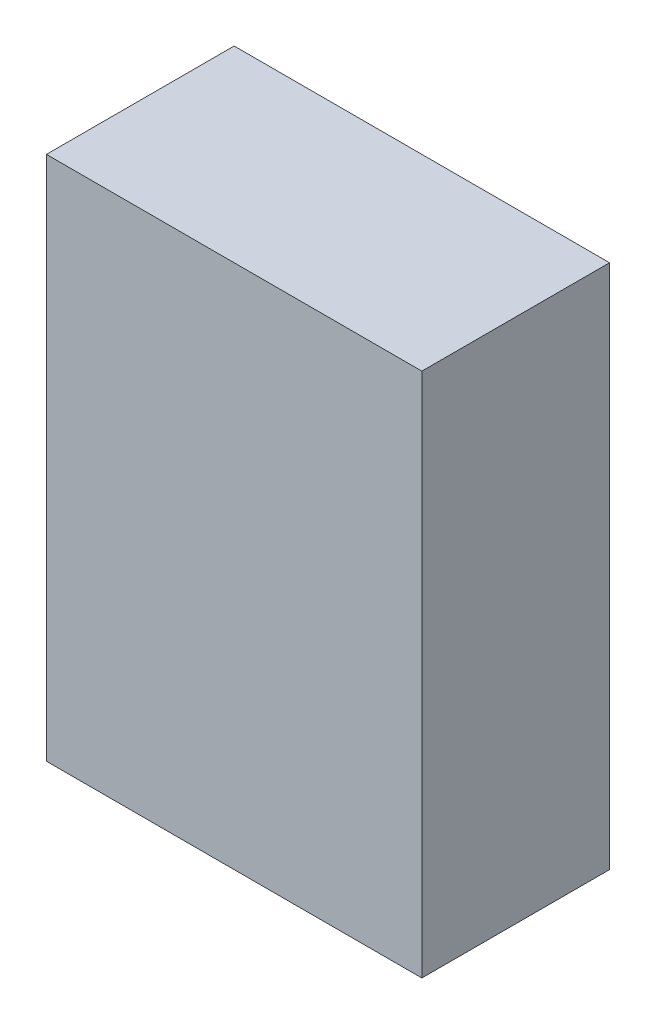
ISO-10303-21;
HEADER;
FILE_DESCRIPTION(('STEP AP214'),'2;1');
FILE_NAME('part.step','',(''),(''),'','','');
FILE_SCHEMA(('AUTOMOTIVE_DESIGN { 1 0 10303 214 1 1 1 1 }'));
ENDSEC;
DATA;
#1=APPLICATION_CONTEXT('core data for automotive mechanical design processes');
#2=APPLICATION_PROTOCOL_DEFINITION('international standard','automotive_design',2000,#1);
#3=PRODUCT_CONTEXT('',#1,'mechanical');
#4=PRODUCT('Part','Part','',(#3));
#5=PRODUCT_RELATED_PRODUCT_CATEGORY('part','',(#4));
#6=PRODUCT_DEFINITION_FORMATION('','',#4);
#7=PRODUCT_DEFINITION_CONTEXT('part definition',#1,'design');
#8=PRODUCT_DEFINITION('design','',#6,#7);
#9=PRODUCT_DEFINITION_SHAPE('','',#8);
#10=(LENGTH_UNIT() NAMED_UNIT(*) SI_UNIT(.MILLI.,.METRE.));
#11=(NAMED_UNIT(*) PLANE_ANGLE_UNIT() SI_UNIT($,.RADIAN.));
#12=(NAMED_UNIT(*) SI_UNIT($,.STERADIAN.) SOLID_ANGLE_UNIT());
#13=UNCERTAINTY_MEASURE_WITH_UNIT(LENGTH_MEASURE(1.E-05),#10,'distance_accuracy_value','');
#14=(GEOMETRIC_REPRESENTATION_CONTEXT(3) GLOBAL_UNCERTAINTY_ASSIGNED_CONTEXT((#13)) GLOBAL_UNIT_ASSIGNED_CONTEXT((#10,
#11,#12)) REPRESENTATION_CONTEXT('',''));
#15=CARTESIAN_POINT('',(0.,0.,0.));
#16=DIRECTION('',(0.,0.,1.));
#17=DIRECTION('',(1.,0.,0.));
#18=AXIS2_PLACEMENT_3D('',#15,#16,#17);
#19=CARTESIAN_POINT('',(-0.5999988,0.84000086,0.));
#20=DIRECTION('',(0.,0.,-1.));
#21=DIRECTION('',(-1.,0.,0.));
#22=AXIS2_PLACEMENT_3D('',#19,#20,#21);
#23=PLANE('',#22);
#24=DIRECTION('',(1.,0.,0.));
#25=VECTOR('',#24,1.);
#26=CARTESIAN_POINT('',(0.5999988,0.84000086,0.));
#27=LINE('',#26,#25);
#28=CARTESIAN_POINT('',(-0.5999988,0.84000086,0.));
#29=VERTEX_POINT('',#28);
#30=CARTESIAN_POINT('',(0.5999988,0.84000086,0.));
#31=VERTEX_POINT('',#30);
#32=EDGE_CURVE('E58',#29,#31,#27,.T.);
#33=ORIENTED_EDGE('',*,*,#32,.T.);
#34=DIRECTION('',(0.,1.,0.));
#35=VECTOR('',#34,1.);
#36=CARTESIAN_POINT('',(0.5999988,-0.83999832,0.));
#37=LINE('',#36,#35);
#38=CARTESIAN_POINT('',(0.5999988,-0.83999832,0.));
#39=VERTEX_POINT('',#38);
#40=EDGE_CURVE('E53',#31,#39,#37,.F.);
#41=ORIENTED_EDGE('',*,*,#40,.T.);
#42=DIRECTION('',(1.,0.,0.));
#43=VECTOR('',#42,1.);
#44=CARTESIAN_POINT('',(-0.5999988,-0.83999832,0.));
#45=LINE('',#44,#43);
#46=CARTESIAN_POINT('',(-0.5999988,-0.83999832,0.));
#47=VERTEX_POINT('',#46);
#48=EDGE_CURVE('E68',#39,#47,#45,.F.);
#49=ORIENTED_EDGE('',*,*,#48,.T.);
#50=DIRECTION('',(0.,1.,0.));
#51=VECTOR('',#50,1.);
#52=CARTESIAN_POINT('',(-0.5999988,0.84000086,0.));
#53=LINE('',#52,#51);
#54=EDGE_CURVE('E20',#47,#29,#53,.T.);
#55=ORIENTED_EDGE('',*,*,#54,.T.);
#56=EDGE_LOOP('',(#33,#41,#49,#55));
#57=FACE_BOUND('',#56,.T.);
#58=ADVANCED_FACE('F17',(#57),#23,.T.);
#59=CARTESIAN_POINT('',(-0.5999988,0.84000086,0.));
#60=DIRECTION('',(1.,0.,0.));
#61=DIRECTION('',(0.,0.,-1.));
#62=AXIS2_PLACEMENT_3D('',#59,#60,#61);
#63=PLANE('',#62);
#64=DIRECTION('',(0.,1.,0.));
#65=VECTOR('',#64,1.);
#66=CARTESIAN_POINT('',(-0.5999988,0.84000086,0.6));
#67=LINE('',#66,#65);
#68=CARTESIAN_POINT('',(-0.5999988,-0.83999832,0.6));
#69=VERTEX_POINT('',#68);
#70=CARTESIAN_POINT('',(-0.5999988,0.84000086,0.6));
#71=VERTEX_POINT('',#70);
#72=EDGE_CURVE('E74',#69,#71,#67,.T.);
#73=ORIENTED_EDGE('',*,*,#72,.T.);
#74=DIRECTION('',(0.,0.,-1.));
#75=VECTOR('',#74,1.);
#76=CARTESIAN_POINT('',(-0.5999988,0.84000086,0.));
#77=LINE('',#76,#75);
#78=EDGE_CURVE('E63',#71,#29,#77,.T.);
#79=ORIENTED_EDGE('',*,*,#78,.T.);
#80=ORIENTED_EDGE('',*,*,#54,.F.);
#81=DIRECTION('',(0.,0.,1.));
#82=VECTOR('',#81,1.);
#83=CARTESIAN_POINT('',(-0.5999988,-0.83999832,0.));
#84=LINE('',#83,#82);
#85=EDGE_CURVE('E80',#47,#69,#84,.T.);
#86=ORIENTED_EDGE('',*,*,#85,.T.);
#87=EDGE_LOOP('',(#73,#79,#80,#86));
#88=FACE_BOUND('',#87,.T.);
#89=ADVANCED_FACE('F73',(#88),#63,.F.);
#90=CARTESIAN_POINT('',(0.5999988,0.84000086,0.));
#91=DIRECTION('',(0.,-1.,0.));
#92=DIRECTION('',(0.,0.,-1.));
#93=AXIS2_PLACEMENT_3D('',#90,#91,#92);
#94=PLANE('',#93);
#95=DIRECTION('',(-1.,0.,0.));
#96=VECTOR('',#95,1.);
#97=CARTESIAN_POINT('',(-0.5999988,0.84000086,0.6));
#98=LINE('',#97,#96);
#99=CARTESIAN_POINT('',(0.5999988,0.84000086,0.6));
#100=VERTEX_POINT('',#99);
#101=EDGE_CURVE('E84',#71,#100,#98,.F.);
#102=ORIENTED_EDGE('',*,*,#101,.T.);
#103=DIRECTION('',(0.,0.,1.));
#104=VECTOR('',#103,1.);
#105=CARTESIAN_POINT('',(0.5999988,0.84000086,0.));
#106=LINE('',#105,#104);
#107=EDGE_CURVE('E65',#100,#31,#106,.F.);
#108=ORIENTED_EDGE('',*,*,#107,.T.);
#109=ORIENTED_EDGE('',*,*,#32,.F.);
#110=ORIENTED_EDGE('',*,*,#78,.F.);
#111=EDGE_LOOP('',(#102,#108,#109,#110));
#112=FACE_BOUND('',#111,.T.);
#113=ADVANCED_FACE('F61',(#112),#94,.F.);
#114=CARTESIAN_POINT('',(0.5999988,-0.83999832,0.));
#115=DIRECTION('',(-1.,0.,0.));
#116=DIRECTION('',(0.,0.,1.));
#117=AXIS2_PLACEMENT_3D('',#114,#115,#116);
#118=PLANE('',#117);
#119=DIRECTION('',(0.,1.,0.));
#120=VECTOR('',#119,1.);
#121=CARTESIAN_POINT('',(0.5999988,0.84000086,0.6));
#122=LINE('',#121,#120);
#123=CARTESIAN_POINT('',(0.5999988,-0.83999832,0.6));
#124=VERTEX_POINT('',#123);
#125=EDGE_CURVE('E26',#100,#124,#122,.F.);
#126=ORIENTED_EDGE('',*,*,#125,.T.);
#127=DIRECTION('',(0.,0.,1.));
#128=VECTOR('',#127,1.);
#129=CARTESIAN_POINT('',(0.5999988,-0.83999832,0.));
#130=LINE('',#129,#128);
#131=EDGE_CURVE('E34',#124,#39,#130,.F.);
#132=ORIENTED_EDGE('',*,*,#131,.T.);
#133=ORIENTED_EDGE('',*,*,#40,.F.);
#134=ORIENTED_EDGE('',*,*,#107,.F.);
#135=EDGE_LOOP('',(#126,#132,#133,#134));
#136=FACE_BOUND('',#135,.T.);
#137=ADVANCED_FACE('F88',(#136),#118,.F.);
#138=CARTESIAN_POINT('',(-0.5999988,-0.83999832,0.));
#139=DIRECTION('',(0.,1.,0.));
#140=DIRECTION('',(0.,0.,1.));
#141=AXIS2_PLACEMENT_3D('',#138,#139,#140);
#142=PLANE('',#141);
#143=DIRECTION('',(-1.,0.,0.));
#144=VECTOR('',#143,1.);
#145=CARTESIAN_POINT('',(-0.5999988,-0.83999832,0.6));
#146=LINE('',#145,#144);
#147=EDGE_CURVE('E11',#124,#69,#146,.T.);
#148=ORIENTED_EDGE('',*,*,#147,.T.);
#149=ORIENTED_EDGE('',*,*,#85,.F.);
#150=ORIENTED_EDGE('',*,*,#48,.F.);
#151=ORIENTED_EDGE('',*,*,#131,.F.);
#152=EDGE_LOOP('',(#148,#149,#150,#151));
#153=FACE_BOUND('',#152,.T.);
#154=ADVANCED_FACE('F91',(#153),#142,.F.);
#155=CARTESIAN_POINT('',(-0.5999988,0.84000086,0.6));
#156=DIRECTION('',(0.,0.,-1.));
#157=DIRECTION('',(-1.,0.,0.));
#158=AXIS2_PLACEMENT_3D('',#155,#156,#157);
#159=PLANE('',#158);
#160=ORIENTED_EDGE('',*,*,#125,.F.);
#161=ORIENTED_EDGE('',*,*,#101,.F.);
#162=ORIENTED_EDGE('',*,*,#72,.F.);
#163=ORIENTED_EDGE('',*,*,#147,.F.);
#164=EDGE_LOOP('',(#160,#161,#162,#163));
#165=FACE_BOUND('',#164,.T.);
#166=ADVANCED_FACE('F90',(#165),#159,.F.);
#167=CLOSED_SHELL('',(#58,#89,#113,#137,#154,#166));
#168=MANIFOLD_SOLID_BREP('B1',#167);
#169=ADVANCED_BREP_SHAPE_REPRESENTATION('',(#18,#168),#14);
#170=SHAPE_DEFINITION_REPRESENTATION(#9,#169);
ENDSEC;
END-ISO-10303-21;
